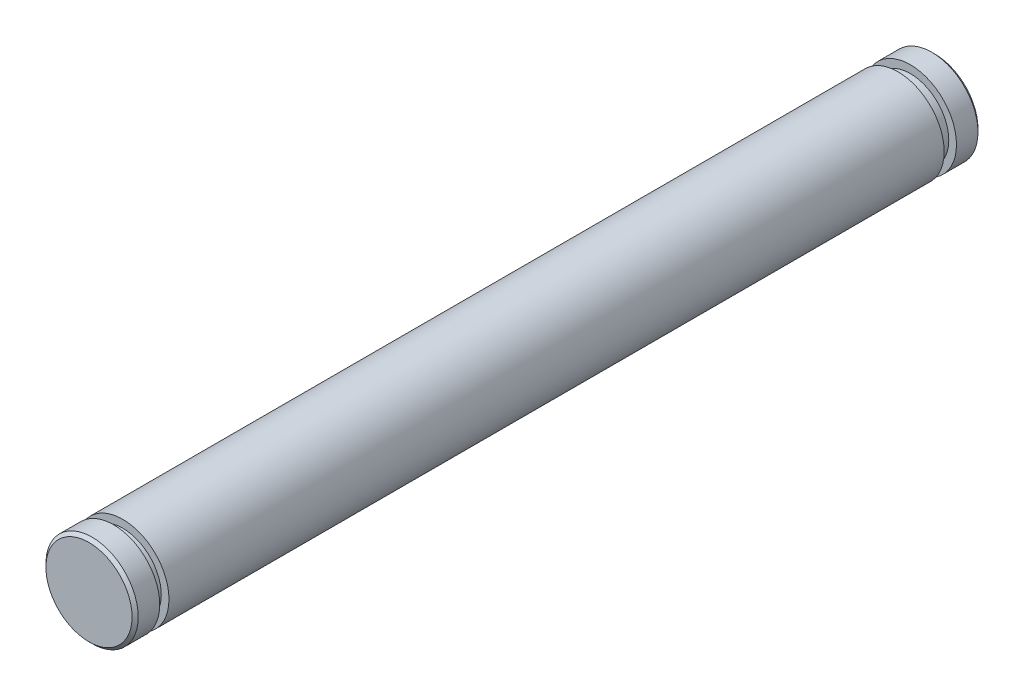
ISO-10303-21;
HEADER;
FILE_DESCRIPTION(('STEP AP214'),'2;1');
FILE_NAME('part.step','',(''),(''),'','','');
FILE_SCHEMA(('AUTOMOTIVE_DESIGN { 1 0 10303 214 1 1 1 1 }'));
ENDSEC;
DATA;
#1=APPLICATION_CONTEXT('core data for automotive mechanical design processes');
#2=APPLICATION_PROTOCOL_DEFINITION('international standard','automotive_design',2000,#1);
#3=PRODUCT_CONTEXT('',#1,'mechanical');
#4=PRODUCT('Part','Part','',(#3));
#5=PRODUCT_RELATED_PRODUCT_CATEGORY('part','',(#4));
#6=PRODUCT_DEFINITION_FORMATION('','',#4);
#7=PRODUCT_DEFINITION_CONTEXT('part definition',#1,'design');
#8=PRODUCT_DEFINITION('design','',#6,#7);
#9=PRODUCT_DEFINITION_SHAPE('','',#8);
#10=(LENGTH_UNIT() NAMED_UNIT(*) SI_UNIT(.MILLI.,.METRE.));
#11=(NAMED_UNIT(*) PLANE_ANGLE_UNIT() SI_UNIT($,.RADIAN.));
#12=(NAMED_UNIT(*) SI_UNIT($,.STERADIAN.) SOLID_ANGLE_UNIT());
#13=UNCERTAINTY_MEASURE_WITH_UNIT(LENGTH_MEASURE(1.E-05),#10,'distance_accuracy_value','');
#14=(GEOMETRIC_REPRESENTATION_CONTEXT(3) GLOBAL_UNCERTAINTY_ASSIGNED_CONTEXT((#13)) GLOBAL_UNIT_ASSIGNED_CONTEXT((#10,
#11,#12)) REPRESENTATION_CONTEXT('',''));
#15=CARTESIAN_POINT('',(0.,0.,0.));
#16=DIRECTION('',(0.,0.,1.));
#17=DIRECTION('',(1.,0.,0.));
#18=AXIS2_PLACEMENT_3D('',#15,#16,#17);
#19=CARTESIAN_POINT('',(0.,0.,27.5));
#20=DIRECTION('',(0.,0.,-1.));
#21=DIRECTION('',(-1.,0.,0.));
#22=AXIS2_PLACEMENT_3D('',#19,#20,#21);
#23=CYLINDRICAL_SURFACE('',#22,1.5);
#24=CARTESIAN_POINT('',(0.,0.,1.2));
#25=DIRECTION('',(0.,0.,1.));
#26=DIRECTION('',(1.,0.,0.));
#27=AXIS2_PLACEMENT_3D('',#24,#25,#26);
#28=CIRCLE('',#27,1.5);
#29=CARTESIAN_POINT('',(1.5,0.,1.2));
#30=VERTEX_POINT('',#29);
#31=EDGE_CURVE('E53',#30,#30,#28,.T.);
#32=ORIENTED_EDGE('',*,*,#31,.T.);
#33=EDGE_LOOP('',(#32));
#34=FACE_BOUND('',#33,.T.);
#35=CARTESIAN_POINT('',(0.,0.,26.4));
#36=DIRECTION('',(0.,0.,1.));
#37=DIRECTION('',(1.,0.,0.));
#38=AXIS2_PLACEMENT_3D('',#35,#36,#37);
#39=CIRCLE('',#38,1.5);
#40=CARTESIAN_POINT('',(1.5,0.,26.4));
#41=VERTEX_POINT('',#40);
#42=EDGE_CURVE('E63',#41,#41,#39,.T.);
#43=ORIENTED_EDGE('',*,*,#42,.F.);
#44=EDGE_LOOP('',(#43));
#45=FACE_BOUND('',#44,.T.);
#46=ADVANCED_FACE('F33',(#34,#45),#23,.T.);
#47=CARTESIAN_POINT('',(0.,0.,1.2));
#48=DIRECTION('',(0.,0.,1.));
#49=DIRECTION('',(1.,0.,0.));
#50=AXIS2_PLACEMENT_3D('',#47,#48,#49);
#51=PLANE('',#50);
#52=ORIENTED_EDGE('',*,*,#31,.F.);
#53=EDGE_LOOP('',(#52));
#54=FACE_BOUND('',#53,.T.);
#55=CARTESIAN_POINT('',(0.,0.,1.2));
#56=DIRECTION('',(0.,0.,1.));
#57=DIRECTION('',(1.,0.,0.));
#58=AXIS2_PLACEMENT_3D('',#55,#56,#57);
#59=CIRCLE('',#58,1.25);
#60=CARTESIAN_POINT('',(1.25,0.,1.2));
#61=VERTEX_POINT('',#60);
#62=EDGE_CURVE('E57',#61,#61,#59,.T.);
#63=ORIENTED_EDGE('',*,*,#62,.T.);
#64=EDGE_LOOP('',(#63));
#65=FACE_BOUND('',#64,.T.);
#66=ADVANCED_FACE('F90',(#54,#65),#51,.F.);
#67=CARTESIAN_POINT('',(0.,0.,0.8));
#68=DIRECTION('',(0.,0.,1.));
#69=DIRECTION('',(1.,0.,0.));
#70=AXIS2_PLACEMENT_3D('',#67,#68,#69);
#71=PLANE('',#70);
#72=CARTESIAN_POINT('',(0.,0.,0.8));
#73=DIRECTION('',(0.,0.,1.));
#74=DIRECTION('',(1.,0.,0.));
#75=AXIS2_PLACEMENT_3D('',#72,#73,#74);
#76=CIRCLE('',#75,1.5);
#77=CARTESIAN_POINT('',(1.5,0.,0.8));
#78=VERTEX_POINT('',#77);
#79=EDGE_CURVE('E54',#78,#78,#76,.T.);
#80=ORIENTED_EDGE('',*,*,#79,.T.);
#81=EDGE_LOOP('',(#80));
#82=FACE_BOUND('',#81,.T.);
#83=CARTESIAN_POINT('',(0.,0.,0.8));
#84=DIRECTION('',(0.,0.,1.));
#85=DIRECTION('',(1.,0.,0.));
#86=AXIS2_PLACEMENT_3D('',#83,#84,#85);
#87=CIRCLE('',#86,1.25);
#88=CARTESIAN_POINT('',(1.25,0.,0.8));
#89=VERTEX_POINT('',#88);
#90=EDGE_CURVE('E60',#89,#89,#87,.T.);
#91=ORIENTED_EDGE('',*,*,#90,.F.);
#92=EDGE_LOOP('',(#91));
#93=FACE_BOUND('',#92,.T.);
#94=ADVANCED_FACE('F97',(#82,#93),#71,.T.);
#95=CARTESIAN_POINT('',(0.,0.,1.2));
#96=DIRECTION('',(0.,0.,-1.));
#97=DIRECTION('',(-1.,0.,0.));
#98=AXIS2_PLACEMENT_3D('',#95,#96,#97);
#99=CYLINDRICAL_SURFACE('',#98,1.25);
#100=ORIENTED_EDGE('',*,*,#62,.F.);
#101=EDGE_LOOP('',(#100));
#102=FACE_BOUND('',#101,.T.);
#103=ORIENTED_EDGE('',*,*,#90,.T.);
#104=EDGE_LOOP('',(#103));
#105=FACE_BOUND('',#104,.T.);
#106=ADVANCED_FACE('F124',(#102,#105),#99,.T.);
#107=CARTESIAN_POINT('',(0.,0.,0.));
#108=DIRECTION('',(0.,0.,1.));
#109=DIRECTION('',(1.,0.,0.));
#110=AXIS2_PLACEMENT_3D('',#107,#108,#109);
#111=PLANE('',#110);
#112=CARTESIAN_POINT('',(0.,0.,0.));
#113=DIRECTION('',(0.,0.,1.));
#114=DIRECTION('',(1.,0.,0.));
#115=AXIS2_PLACEMENT_3D('',#112,#113,#114);
#116=CIRCLE('',#115,1.4);
#117=CARTESIAN_POINT('',(1.4,0.,0.));
#118=VERTEX_POINT('',#117);
#119=EDGE_CURVE('E44',#118,#118,#116,.F.);
#120=ORIENTED_EDGE('',*,*,#119,.T.);
#121=EDGE_LOOP('',(#120));
#122=FACE_BOUND('',#121,.T.);
#123=ADVANCED_FACE('F102',(#122),#111,.F.);
#124=CARTESIAN_POINT('',(0.,0.,0.0999999999999994));
#125=DIRECTION('',(0.,0.,1.));
#126=DIRECTION('',(1.,0.,0.));
#127=AXIS2_PLACEMENT_3D('',#124,#125,#126);
#128=CIRCLE('',#127,1.5);
#129=CARTESIAN_POINT('',(1.5,0.,0.0999999999999994));
#130=VERTEX_POINT('',#129);
#131=EDGE_CURVE('E48',#130,#130,#128,.T.);
#132=ORIENTED_EDGE('',*,*,#131,.T.);
#133=EDGE_LOOP('',(#132));
#134=FACE_BOUND('',#133,.T.);
#135=ORIENTED_EDGE('',*,*,#79,.F.);
#136=EDGE_LOOP('',(#135));
#137=FACE_BOUND('',#136,.T.);
#138=ADVANCED_FACE('F85',(#134,#137),#23,.T.);
#139=CARTESIAN_POINT('',(0.,0.,26.4));
#140=DIRECTION('',(0.,0.,1.));
#141=DIRECTION('',(1.,0.,0.));
#142=AXIS2_PLACEMENT_3D('',#139,#140,#141);
#143=PLANE('',#142);
#144=CARTESIAN_POINT('',(0.,0.,26.4));
#145=DIRECTION('',(0.,0.,1.));
#146=DIRECTION('',(1.,0.,0.));
#147=AXIS2_PLACEMENT_3D('',#144,#145,#146);
#148=CIRCLE('',#147,1.25);
#149=CARTESIAN_POINT('',(1.25,0.,26.4));
#150=VERTEX_POINT('',#149);
#151=EDGE_CURVE('E69',#150,#150,#148,.T.);
#152=ORIENTED_EDGE('',*,*,#151,.F.);
#153=EDGE_LOOP('',(#152));
#154=FACE_BOUND('',#153,.T.);
#155=ORIENTED_EDGE('',*,*,#42,.T.);
#156=EDGE_LOOP('',(#155));
#157=FACE_BOUND('',#156,.T.);
#158=ADVANCED_FACE('F81',(#154,#157),#143,.T.);
#159=CARTESIAN_POINT('',(0.,0.,26.7));
#160=DIRECTION('',(0.,0.,1.));
#161=DIRECTION('',(1.,0.,0.));
#162=AXIS2_PLACEMENT_3D('',#159,#160,#161);
#163=PLANE('',#162);
#164=CARTESIAN_POINT('',(0.,0.,26.7));
#165=DIRECTION('',(0.,0.,1.));
#166=DIRECTION('',(1.,0.,0.));
#167=AXIS2_PLACEMENT_3D('',#164,#165,#166);
#168=CIRCLE('',#167,1.25);
#169=CARTESIAN_POINT('',(1.25,0.,26.7));
#170=VERTEX_POINT('',#169);
#171=EDGE_CURVE('E72',#170,#170,#168,.T.);
#172=ORIENTED_EDGE('',*,*,#171,.T.);
#173=EDGE_LOOP('',(#172));
#174=FACE_BOUND('',#173,.T.);
#175=CARTESIAN_POINT('',(0.,0.,26.7));
#176=DIRECTION('',(0.,0.,1.));
#177=DIRECTION('',(1.,0.,0.));
#178=AXIS2_PLACEMENT_3D('',#175,#176,#177);
#179=CIRCLE('',#178,1.5);
#180=CARTESIAN_POINT('',(1.5,0.,26.7));
#181=VERTEX_POINT('',#180);
#182=EDGE_CURVE('E66',#181,#181,#179,.T.);
#183=ORIENTED_EDGE('',*,*,#182,.F.);
#184=EDGE_LOOP('',(#183));
#185=FACE_BOUND('',#184,.T.);
#186=ADVANCED_FACE('F84',(#174,#185),#163,.F.);
#187=CARTESIAN_POINT('',(0.,0.,26.4));
#188=DIRECTION('',(0.,0.,1.));
#189=DIRECTION('',(1.,0.,0.));
#190=AXIS2_PLACEMENT_3D('',#187,#188,#189);
#191=CYLINDRICAL_SURFACE('',#190,1.25);
#192=ORIENTED_EDGE('',*,*,#151,.T.);
#193=EDGE_LOOP('',(#192));
#194=FACE_BOUND('',#193,.T.);
#195=ORIENTED_EDGE('',*,*,#171,.F.);
#196=EDGE_LOOP('',(#195));
#197=FACE_BOUND('',#196,.T.);
#198=ADVANCED_FACE('F78',(#194,#197),#191,.T.);
#199=CARTESIAN_POINT('',(0.,0.,27.5));
#200=DIRECTION('',(0.,0.,1.));
#201=DIRECTION('',(1.,0.,0.));
#202=AXIS2_PLACEMENT_3D('',#199,#200,#201);
#203=PLANE('',#202);
#204=CARTESIAN_POINT('',(0.,0.,27.5));
#205=DIRECTION('',(0.,0.,1.));
#206=DIRECTION('',(1.,0.,0.));
#207=AXIS2_PLACEMENT_3D('',#204,#205,#206);
#208=CIRCLE('',#207,1.40000000000001);
#209=CARTESIAN_POINT('',(1.40000000000001,0.,27.5));
#210=VERTEX_POINT('',#209);
#211=EDGE_CURVE('E40',#210,#210,#208,.T.);
#212=ORIENTED_EDGE('',*,*,#211,.T.);
#213=EDGE_LOOP('',(#212));
#214=FACE_BOUND('',#213,.T.);
#215=ADVANCED_FACE('F106',(#214),#203,.T.);
#216=CARTESIAN_POINT('',(0.,0.,27.4));
#217=DIRECTION('',(0.,0.,1.));
#218=DIRECTION('',(1.,0.,0.));
#219=AXIS2_PLACEMENT_3D('',#216,#217,#218);
#220=CIRCLE('',#219,1.5);
#221=CARTESIAN_POINT('',(1.5,0.,27.4));
#222=VERTEX_POINT('',#221);
#223=EDGE_CURVE('E10',#222,#222,#220,.F.);
#224=ORIENTED_EDGE('',*,*,#223,.T.);
#225=EDGE_LOOP('',(#224));
#226=FACE_BOUND('',#225,.T.);
#227=ORIENTED_EDGE('',*,*,#182,.T.);
#228=EDGE_LOOP('',(#227));
#229=FACE_BOUND('',#228,.T.);
#230=ADVANCED_FACE('F93',(#226,#229),#23,.T.);
#231=CARTESIAN_POINT('',(0.,0.,0.0999999999999994));
#232=DIRECTION('',(0.,0.,1.));
#233=DIRECTION('',(1.,0.,0.));
#234=AXIS2_PLACEMENT_3D('',#231,#232,#233);
#235=CONICAL_SURFACE('',#234,1.5,0.785398163397459);
#236=ORIENTED_EDGE('',*,*,#119,.F.);
#237=EDGE_LOOP('',(#236));
#238=FACE_BOUND('',#237,.T.);
#239=ORIENTED_EDGE('',*,*,#131,.F.);
#240=EDGE_LOOP('',(#239));
#241=FACE_BOUND('',#240,.T.);
#242=ADVANCED_FACE('F105',(#238,#241),#235,.T.);
#243=CARTESIAN_POINT('',(0.,0.,27.5));
#244=DIRECTION('',(0.,0.,-1.));
#245=DIRECTION('',(-1.,0.,0.));
#246=AXIS2_PLACEMENT_3D('',#243,#244,#245);
#247=CONICAL_SURFACE('',#246,1.40000000000001,0.785398163397444);
#248=ORIENTED_EDGE('',*,*,#223,.F.);
#249=EDGE_LOOP('',(#248));
#250=FACE_BOUND('',#249,.T.);
#251=ORIENTED_EDGE('',*,*,#211,.F.);
#252=EDGE_LOOP('',(#251));
#253=FACE_BOUND('',#252,.T.);
#254=ADVANCED_FACE('F35',(#250,#253),#247,.T.);
#255=CLOSED_SHELL('',(#46,#66,#94,#106,#123,#138,#158,#186,#198,#215,#230,#242,#254));
#256=MANIFOLD_SOLID_BREP('B2',#255);
#257=ADVANCED_BREP_SHAPE_REPRESENTATION('',(#18,#256),#14);
#258=SHAPE_DEFINITION_REPRESENTATION(#9,#257);
ENDSEC;
END-ISO-10303-21;
